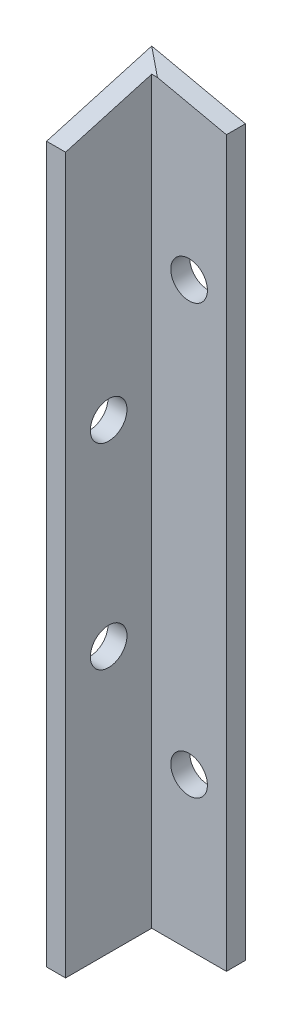
ISO-10303-21;
HEADER;
FILE_DESCRIPTION(('STEP AP214'),'2;1');
FILE_NAME('part.step','',(''),(''),'','','');
FILE_SCHEMA(('AUTOMOTIVE_DESIGN { 1 0 10303 214 1 1 1 1 }'));
ENDSEC;
DATA;
#1=APPLICATION_CONTEXT('core data for automotive mechanical design processes');
#2=APPLICATION_PROTOCOL_DEFINITION('international standard','automotive_design',2000,#1);
#3=PRODUCT_CONTEXT('',#1,'mechanical');
#4=PRODUCT('Part','Part','',(#3));
#5=PRODUCT_RELATED_PRODUCT_CATEGORY('part','',(#4));
#6=PRODUCT_DEFINITION_FORMATION('','',#4);
#7=PRODUCT_DEFINITION_CONTEXT('part definition',#1,'design');
#8=PRODUCT_DEFINITION('design','',#6,#7);
#9=PRODUCT_DEFINITION_SHAPE('','',#8);
#10=(LENGTH_UNIT() NAMED_UNIT(*) SI_UNIT(.MILLI.,.METRE.));
#11=(NAMED_UNIT(*) PLANE_ANGLE_UNIT() SI_UNIT($,.RADIAN.));
#12=(NAMED_UNIT(*) SI_UNIT($,.STERADIAN.) SOLID_ANGLE_UNIT());
#13=UNCERTAINTY_MEASURE_WITH_UNIT(LENGTH_MEASURE(1.E-05),#10,'distance_accuracy_value','');
#14=(GEOMETRIC_REPRESENTATION_CONTEXT(3) GLOBAL_UNCERTAINTY_ASSIGNED_CONTEXT((#13)) GLOBAL_UNIT_ASSIGNED_CONTEXT((#10,
#11,#12)) REPRESENTATION_CONTEXT('',''));
#15=CARTESIAN_POINT('',(0.,0.,0.));
#16=DIRECTION('',(0.,0.,1.));
#17=DIRECTION('',(1.,0.,0.));
#18=AXIS2_PLACEMENT_3D('',#15,#16,#17);
#19=CARTESIAN_POINT('',(0.,100.,0.));
#20=DIRECTION('',(0.,0.,-1.));
#21=DIRECTION('',(-1.,0.,0.));
#22=AXIS2_PLACEMENT_3D('',#19,#20,#21);
#23=PLANE('',#22);
#24=DIRECTION('',(0.,-1.,0.));
#25=VECTOR('',#24,1.);
#26=CARTESIAN_POINT('',(2.5,100.,0.));
#27=LINE('',#26,#25);
#28=CARTESIAN_POINT('',(2.5,94.2174692830297,0.));
#29=VERTEX_POINT('',#28);
#30=CARTESIAN_POINT('',(2.5,0.,0.));
#31=VERTEX_POINT('',#30);
#32=EDGE_CURVE('E165',#29,#31,#27,.T.);
#33=ORIENTED_EDGE('',*,*,#32,.F.);
#34=DIRECTION('',(-1.,0.,0.));
#35=VECTOR('',#34,1.);
#36=CARTESIAN_POINT('',(0.,94.2174692830297,0.));
#37=LINE('',#36,#35);
#38=CARTESIAN_POINT('',(0.,94.2174692830297,0.));
#39=VERTEX_POINT('',#38);
#40=EDGE_CURVE('E122',#29,#39,#37,.T.);
#41=ORIENTED_EDGE('',*,*,#40,.T.);
#42=DIRECTION('',(0.,-1.,0.));
#43=VECTOR('',#42,1.);
#44=CARTESIAN_POINT('',(0.,100.,0.));
#45=LINE('',#44,#43);
#46=CARTESIAN_POINT('',(0.,0.,0.));
#47=VERTEX_POINT('',#46);
#48=EDGE_CURVE('E120',#39,#47,#45,.T.);
#49=ORIENTED_EDGE('',*,*,#48,.T.);
#50=DIRECTION('',(1.,0.,0.));
#51=VECTOR('',#50,1.);
#52=CARTESIAN_POINT('',(0.,0.,0.));
#53=LINE('',#52,#51);
#54=EDGE_CURVE('E121',#47,#31,#53,.T.);
#55=ORIENTED_EDGE('',*,*,#54,.T.);
#56=EDGE_LOOP('',(#33,#41,#49,#55));
#57=FACE_BOUND('',#56,.T.);
#58=ADVANCED_FACE('F37',(#57),#23,.F.);
#59=CARTESIAN_POINT('',(2.5,100.,0.));
#60=DIRECTION('',(-1.,0.,0.));
#61=DIRECTION('',(0.,0.,1.));
#62=AXIS2_PLACEMENT_3D('',#59,#60,#61);
#63=PLANE('',#62);
#64=CARTESIAN_POINT('',(2.5,35.,-5.675));
#65=DIRECTION('',(1.,0.,0.));
#66=DIRECTION('',(0.,0.,-1.));
#67=AXIS2_PLACEMENT_3D('',#64,#65,#66);
#68=CIRCLE('',#67,2.415);
#69=CARTESIAN_POINT('',(2.5,35.,-8.09));
#70=VERTEX_POINT('',#69);
#71=EDGE_CURVE('E128',#70,#70,#68,.T.);
#72=ORIENTED_EDGE('',*,*,#71,.F.);
#73=EDGE_LOOP('',(#72));
#74=FACE_BOUND('',#73,.T.);
#75=CARTESIAN_POINT('',(2.5,60.8318940802685,-5.675));
#76=DIRECTION('',(1.,0.,0.));
#77=DIRECTION('',(0.,0.,-1.));
#78=AXIS2_PLACEMENT_3D('',#75,#76,#77);
#79=CIRCLE('',#78,2.415);
#80=CARTESIAN_POINT('',(2.5,60.8318940802685,-8.09));
#81=VERTEX_POINT('',#80);
#82=EDGE_CURVE('E137',#81,#81,#79,.T.);
#83=ORIENTED_EDGE('',*,*,#82,.F.);
#84=EDGE_LOOP('',(#83));
#85=FACE_BOUND('',#84,.T.);
#86=DIRECTION('',(0.,-1.,0.));
#87=VECTOR('',#86,1.);
#88=CARTESIAN_POINT('',(2.5,100.,-11.35));
#89=LINE('',#88,#87);
#90=CARTESIAN_POINT('',(2.5,97.4463188775074,-11.35));
#91=VERTEX_POINT('',#90);
#92=CARTESIAN_POINT('',(2.5,0.,-11.35));
#93=VERTEX_POINT('',#92);
#94=EDGE_CURVE('E111',#91,#93,#89,.T.);
#95=ORIENTED_EDGE('',*,*,#94,.F.);
#96=DIRECTION('',(0.,-0.273623490960616,0.961836880762287));
#97=VECTOR('',#96,1.);
#98=CARTESIAN_POINT('',(2.5,94.6504062869162,-1.52185317102299));
#99=LINE('',#98,#97);
#100=EDGE_CURVE('E153',#91,#29,#99,.T.);
#101=ORIENTED_EDGE('',*,*,#100,.T.);
#102=ORIENTED_EDGE('',*,*,#32,.T.);
#103=DIRECTION('',(0.,0.,-1.));
#104=VECTOR('',#103,1.);
#105=CARTESIAN_POINT('',(2.5,0.,0.));
#106=LINE('',#105,#104);
#107=EDGE_CURVE('E162',#31,#93,#106,.T.);
#108=ORIENTED_EDGE('',*,*,#107,.T.);
#109=EDGE_LOOP('',(#95,#101,#102,#108));
#110=FACE_BOUND('',#109,.T.);
#111=ADVANCED_FACE('F173',(#74,#85,#110),#63,.F.);
#112=CARTESIAN_POINT('',(2.5,100.,-11.35));
#113=DIRECTION('',(0.,0.,-1.));
#114=DIRECTION('',(-1.,0.,0.));
#115=AXIS2_PLACEMENT_3D('',#112,#113,#114);
#116=PLANE('',#115);
#117=CARTESIAN_POINT('',(7.42,20.,-11.35));
#118=DIRECTION('',(0.,0.,1.));
#119=DIRECTION('',(1.,0.,0.));
#120=AXIS2_PLACEMENT_3D('',#117,#118,#119);
#121=CIRCLE('',#120,2.415);
#122=CARTESIAN_POINT('',(9.835,20.,-11.35));
#123=VERTEX_POINT('',#122);
#124=EDGE_CURVE('E133',#123,#123,#121,.T.);
#125=ORIENTED_EDGE('',*,*,#124,.F.);
#126=EDGE_LOOP('',(#125));
#127=FACE_BOUND('',#126,.T.);
#128=CARTESIAN_POINT('',(7.42,76.4509969360503,-11.35));
#129=DIRECTION('',(0.,0.,1.));
#130=DIRECTION('',(1.,0.,0.));
#131=AXIS2_PLACEMENT_3D('',#128,#129,#130);
#132=CIRCLE('',#131,2.415);
#133=CARTESIAN_POINT('',(9.835,76.4509969360503,-11.35));
#134=VERTEX_POINT('',#133);
#135=EDGE_CURVE('E139',#134,#134,#132,.T.);
#136=ORIENTED_EDGE('',*,*,#135,.F.);
#137=EDGE_LOOP('',(#136));
#138=FACE_BOUND('',#137,.T.);
#139=DIRECTION('',(0.976859298345142,-0.213882938161597,0.));
#140=VECTOR('',#139,1.);
#141=CARTESIAN_POINT('',(2.00067787036335,97.7194652860223,-11.35));
#142=LINE('',#141,#140);
#143=CARTESIAN_POINT('',(3.24820893226524,97.4463188775074,-11.35));
#144=VERTEX_POINT('',#143);
#145=CARTESIAN_POINT('',(12.34,95.4556749945933,-11.35));
#146=VERTEX_POINT('',#145);
#147=EDGE_CURVE('E88',#144,#146,#142,.T.);
#148=ORIENTED_EDGE('',*,*,#147,.F.);
#149=DIRECTION('',(-1.,0.,0.));
#150=VECTOR('',#149,1.);
#151=CARTESIAN_POINT('',(2.5,97.4463188775074,-11.35));
#152=LINE('',#151,#150);
#153=EDGE_CURVE('E52',#144,#91,#152,.T.);
#154=ORIENTED_EDGE('',*,*,#153,.T.);
#155=ORIENTED_EDGE('',*,*,#94,.T.);
#156=DIRECTION('',(1.,0.,0.));
#157=VECTOR('',#156,1.);
#158=CARTESIAN_POINT('',(2.5,0.,-11.35));
#159=LINE('',#158,#157);
#160=CARTESIAN_POINT('',(12.34,0.,-11.35));
#161=VERTEX_POINT('',#160);
#162=EDGE_CURVE('E106',#93,#161,#159,.T.);
#163=ORIENTED_EDGE('',*,*,#162,.T.);
#164=DIRECTION('',(0.,-1.,0.));
#165=VECTOR('',#164,1.);
#166=CARTESIAN_POINT('',(12.34,100.,-11.35));
#167=LINE('',#166,#165);
#168=EDGE_CURVE('E100',#146,#161,#167,.T.);
#169=ORIENTED_EDGE('',*,*,#168,.F.);
#170=EDGE_LOOP('',(#148,#154,#155,#163,#169));
#171=FACE_BOUND('',#170,.T.);
#172=ADVANCED_FACE('F104',(#127,#138,#171),#116,.F.);
#173=CARTESIAN_POINT('',(12.34,100.,-11.35));
#174=DIRECTION('',(-1.,0.,0.));
#175=DIRECTION('',(0.,0.,1.));
#176=AXIS2_PLACEMENT_3D('',#173,#174,#175);
#177=PLANE('',#176);
#178=DIRECTION('',(0.,0.,-1.));
#179=VECTOR('',#178,1.);
#180=CARTESIAN_POINT('',(12.34,95.4556749945933,-11.35));
#181=LINE('',#180,#179);
#182=CARTESIAN_POINT('',(12.34,95.4556749945933,-13.85));
#183=VERTEX_POINT('',#182);
#184=EDGE_CURVE('E91',#146,#183,#181,.T.);
#185=ORIENTED_EDGE('',*,*,#184,.F.);
#186=ORIENTED_EDGE('',*,*,#168,.T.);
#187=DIRECTION('',(0.,0.,-1.));
#188=VECTOR('',#187,1.);
#189=CARTESIAN_POINT('',(12.34,0.,-11.35));
#190=LINE('',#189,#188);
#191=CARTESIAN_POINT('',(12.34,0.,-13.85));
#192=VERTEX_POINT('',#191);
#193=EDGE_CURVE('E108',#161,#192,#190,.T.);
#194=ORIENTED_EDGE('',*,*,#193,.T.);
#195=DIRECTION('',(0.,-1.,0.));
#196=VECTOR('',#195,1.);
#197=CARTESIAN_POINT('',(12.34,100.,-13.85));
#198=LINE('',#197,#196);
#199=EDGE_CURVE('E102',#183,#192,#198,.T.);
#200=ORIENTED_EDGE('',*,*,#199,.F.);
#201=EDGE_LOOP('',(#185,#186,#194,#200));
#202=FACE_BOUND('',#201,.T.);
#203=ADVANCED_FACE('F98',(#202),#177,.F.);
#204=CARTESIAN_POINT('',(0.,100.,-13.85));
#205=DIRECTION('',(0.,0.,1.));
#206=DIRECTION('',(1.,0.,0.));
#207=AXIS2_PLACEMENT_3D('',#204,#205,#206);
#208=PLANE('',#207);
#209=CARTESIAN_POINT('',(7.42,20.,-13.85));
#210=DIRECTION('',(0.,0.,1.));
#211=DIRECTION('',(1.,0.,0.));
#212=AXIS2_PLACEMENT_3D('',#209,#210,#211);
#213=CIRCLE('',#212,2.415);
#214=CARTESIAN_POINT('',(9.835,20.,-13.85));
#215=VERTEX_POINT('',#214);
#216=EDGE_CURVE('E40',#215,#215,#213,.T.);
#217=ORIENTED_EDGE('',*,*,#216,.T.);
#218=EDGE_LOOP('',(#217));
#219=FACE_BOUND('',#218,.T.);
#220=CARTESIAN_POINT('',(7.42,76.4509969360503,-13.85));
#221=DIRECTION('',(0.,0.,1.));
#222=DIRECTION('',(1.,0.,0.));
#223=AXIS2_PLACEMENT_3D('',#220,#221,#222);
#224=CIRCLE('',#223,2.415);
#225=CARTESIAN_POINT('',(9.835,76.4509969360503,-13.85));
#226=VERTEX_POINT('',#225);
#227=EDGE_CURVE('E131',#226,#226,#224,.T.);
#228=ORIENTED_EDGE('',*,*,#227,.T.);
#229=EDGE_LOOP('',(#228));
#230=FACE_BOUND('',#229,.T.);
#231=DIRECTION('',(0.976859298345142,-0.213882938161597,0.));
#232=VECTOR('',#231,1.);
#233=CARTESIAN_POINT('',(0.,98.1575128758371,-13.85));
#234=LINE('',#233,#232);
#235=CARTESIAN_POINT('',(0.,98.1575128758371,-13.85));
#236=VERTEX_POINT('',#235);
#237=EDGE_CURVE('E61',#236,#183,#234,.T.);
#238=ORIENTED_EDGE('',*,*,#237,.T.);
#239=ORIENTED_EDGE('',*,*,#199,.T.);
#240=DIRECTION('',(-1.,0.,0.));
#241=VECTOR('',#240,1.);
#242=CARTESIAN_POINT('',(0.,0.,-13.85));
#243=LINE('',#242,#241);
#244=CARTESIAN_POINT('',(0.,0.,-13.85));
#245=VERTEX_POINT('',#244);
#246=EDGE_CURVE('E117',#192,#245,#243,.T.);
#247=ORIENTED_EDGE('',*,*,#246,.T.);
#248=DIRECTION('',(0.,-1.,0.));
#249=VECTOR('',#248,1.);
#250=CARTESIAN_POINT('',(0.,100.,-13.85));
#251=LINE('',#250,#249);
#252=EDGE_CURVE('E118',#236,#245,#251,.T.);
#253=ORIENTED_EDGE('',*,*,#252,.F.);
#254=EDGE_LOOP('',(#238,#239,#247,#253));
#255=FACE_BOUND('',#254,.T.);
#256=ADVANCED_FACE('F188',(#219,#230,#255),#208,.F.);
#257=CARTESIAN_POINT('',(0.,100.,0.));
#258=DIRECTION('',(1.,0.,0.));
#259=DIRECTION('',(0.,0.,-1.));
#260=AXIS2_PLACEMENT_3D('',#257,#258,#259);
#261=PLANE('',#260);
#262=CARTESIAN_POINT('',(0.,35.,-5.675));
#263=DIRECTION('',(1.,0.,0.));
#264=DIRECTION('',(0.,0.,-1.));
#265=AXIS2_PLACEMENT_3D('',#262,#263,#264);
#266=CIRCLE('',#265,2.415);
#267=CARTESIAN_POINT('',(0.,35.,-8.09));
#268=VERTEX_POINT('',#267);
#269=EDGE_CURVE('E127',#268,#268,#266,.T.);
#270=ORIENTED_EDGE('',*,*,#269,.T.);
#271=EDGE_LOOP('',(#270));
#272=FACE_BOUND('',#271,.T.);
#273=CARTESIAN_POINT('',(0.,60.8318940802685,-5.675));
#274=DIRECTION('',(1.,0.,0.));
#275=DIRECTION('',(0.,0.,-1.));
#276=AXIS2_PLACEMENT_3D('',#273,#274,#275);
#277=CIRCLE('',#276,2.415);
#278=CARTESIAN_POINT('',(0.,60.8318940802685,-8.09));
#279=VERTEX_POINT('',#278);
#280=EDGE_CURVE('E124',#279,#279,#277,.T.);
#281=ORIENTED_EDGE('',*,*,#280,.T.);
#282=EDGE_LOOP('',(#281));
#283=FACE_BOUND('',#282,.T.);
#284=ORIENTED_EDGE('',*,*,#48,.F.);
#285=DIRECTION('',(0.,-0.273623490960616,0.961836880762287));
#286=VECTOR('',#285,1.);
#287=CARTESIAN_POINT('',(0.,98.1575128758371,-13.8499776684699));
#288=LINE('',#287,#286);
#289=CARTESIAN_POINT('',(0.,98.1575128758371,-13.8499776684699));
#290=VERTEX_POINT('',#289);
#291=EDGE_CURVE('E130',#290,#39,#288,.T.);
#292=ORIENTED_EDGE('',*,*,#291,.F.);
#293=DIRECTION('',(0.,0.,1.));
#294=VECTOR('',#293,1.);
#295=CARTESIAN_POINT('',(0.,98.1575128758371,0.));
#296=LINE('',#295,#294);
#297=EDGE_CURVE('E45',#236,#290,#296,.T.);
#298=ORIENTED_EDGE('',*,*,#297,.F.);
#299=ORIENTED_EDGE('',*,*,#252,.T.);
#300=DIRECTION('',(0.,0.,1.));
#301=VECTOR('',#300,1.);
#302=CARTESIAN_POINT('',(0.,0.,0.));
#303=LINE('',#302,#301);
#304=EDGE_CURVE('E94',#245,#47,#303,.T.);
#305=ORIENTED_EDGE('',*,*,#304,.T.);
#306=EDGE_LOOP('',(#284,#292,#298,#299,#305));
#307=FACE_BOUND('',#306,.T.);
#308=ADVANCED_FACE('F184',(#272,#283,#307),#261,.F.);
#309=CARTESIAN_POINT('',(0.,0.,0.));
#310=DIRECTION('',(0.,1.,0.));
#311=DIRECTION('',(0.,0.,1.));
#312=AXIS2_PLACEMENT_3D('',#309,#310,#311);
#313=PLANE('',#312);
#314=ORIENTED_EDGE('',*,*,#54,.F.);
#315=ORIENTED_EDGE('',*,*,#304,.F.);
#316=ORIENTED_EDGE('',*,*,#246,.F.);
#317=ORIENTED_EDGE('',*,*,#193,.F.);
#318=ORIENTED_EDGE('',*,*,#162,.F.);
#319=ORIENTED_EDGE('',*,*,#107,.F.);
#320=EDGE_LOOP('',(#314,#315,#316,#317,#318,#319));
#321=FACE_BOUND('',#320,.T.);
#322=ADVANCED_FACE('F177',(#321),#313,.F.);
#323=CARTESIAN_POINT('',(0.,98.1575128758371,2.15));
#324=DIRECTION('',(0.213882938161597,0.976859298345142,0.));
#325=DIRECTION('',(-0.976859298345142,0.213882938161597,0.));
#326=AXIS2_PLACEMENT_3D('',#323,#324,#325);
#327=PLANE('',#326);
#328=DIRECTION('',(-0.780798102649057,0.170955420692097,-0.600939736608939));
#329=VECTOR('',#328,1.);
#330=CARTESIAN_POINT('',(7.50739122017548,96.5137726823211,-8.0719286604534));
#331=LINE('',#330,#329);
#332=EDGE_CURVE('E11',#144,#290,#331,.T.);
#333=ORIENTED_EDGE('',*,*,#332,.F.);
#334=ORIENTED_EDGE('',*,*,#147,.T.);
#335=ORIENTED_EDGE('',*,*,#184,.T.);
#336=ORIENTED_EDGE('',*,*,#237,.F.);
#337=ORIENTED_EDGE('',*,*,#297,.T.);
#338=EDGE_LOOP('',(#333,#334,#335,#336,#337));
#339=FACE_BOUND('',#338,.T.);
#340=ADVANCED_FACE('F90',(#339),#327,.T.);
#341=CARTESIAN_POINT('',(16.,98.1575128758371,-13.8499776684699));
#342=DIRECTION('',(0.,-0.961836880762287,-0.273623490960616));
#343=DIRECTION('',(0.,0.273623490960616,-0.961836880762287));
#344=AXIS2_PLACEMENT_3D('',#341,#342,#343);
#345=PLANE('',#344);
#346=ORIENTED_EDGE('',*,*,#100,.F.);
#347=ORIENTED_EDGE('',*,*,#153,.F.);
#348=ORIENTED_EDGE('',*,*,#332,.T.);
#349=ORIENTED_EDGE('',*,*,#291,.T.);
#350=ORIENTED_EDGE('',*,*,#40,.F.);
#351=EDGE_LOOP('',(#346,#347,#348,#349,#350));
#352=FACE_BOUND('',#351,.T.);
#353=ADVANCED_FACE('F217',(#352),#345,.F.);
#354=CARTESIAN_POINT('',(-13.5,60.8318940802685,-5.675));
#355=DIRECTION('',(1.,0.,0.));
#356=DIRECTION('',(0.,0.,-1.));
#357=AXIS2_PLACEMENT_3D('',#354,#355,#356);
#358=CYLINDRICAL_SURFACE('',#357,2.415);
#359=ORIENTED_EDGE('',*,*,#82,.T.);
#360=EDGE_LOOP('',(#359));
#361=FACE_BOUND('',#360,.T.);
#362=ORIENTED_EDGE('',*,*,#280,.F.);
#363=EDGE_LOOP('',(#362));
#364=FACE_BOUND('',#363,.T.);
#365=ADVANCED_FACE('F213',(#361,#364),#358,.F.);
#366=CARTESIAN_POINT('',(-13.5,35.,-5.675));
#367=DIRECTION('',(1.,0.,0.));
#368=DIRECTION('',(0.,0.,-1.));
#369=AXIS2_PLACEMENT_3D('',#366,#367,#368);
#370=CYLINDRICAL_SURFACE('',#369,2.415);
#371=ORIENTED_EDGE('',*,*,#71,.T.);
#372=EDGE_LOOP('',(#371));
#373=FACE_BOUND('',#372,.T.);
#374=ORIENTED_EDGE('',*,*,#269,.F.);
#375=EDGE_LOOP('',(#374));
#376=FACE_BOUND('',#375,.T.);
#377=ADVANCED_FACE('F216',(#373,#376),#370,.F.);
#378=CARTESIAN_POINT('',(7.42,76.4509969360503,-27.35));
#379=DIRECTION('',(0.,0.,1.));
#380=DIRECTION('',(1.,0.,0.));
#381=AXIS2_PLACEMENT_3D('',#378,#379,#380);
#382=CYLINDRICAL_SURFACE('',#381,2.415);
#383=ORIENTED_EDGE('',*,*,#135,.T.);
#384=EDGE_LOOP('',(#383));
#385=FACE_BOUND('',#384,.T.);
#386=ORIENTED_EDGE('',*,*,#227,.F.);
#387=EDGE_LOOP('',(#386));
#388=FACE_BOUND('',#387,.T.);
#389=ADVANCED_FACE('F225',(#385,#388),#382,.F.);
#390=CARTESIAN_POINT('',(7.42,20.,-27.35));
#391=DIRECTION('',(0.,0.,1.));
#392=DIRECTION('',(1.,0.,0.));
#393=AXIS2_PLACEMENT_3D('',#390,#391,#392);
#394=CYLINDRICAL_SURFACE('',#393,2.415);
#395=ORIENTED_EDGE('',*,*,#124,.T.);
#396=EDGE_LOOP('',(#395));
#397=FACE_BOUND('',#396,.T.);
#398=ORIENTED_EDGE('',*,*,#216,.F.);
#399=EDGE_LOOP('',(#398));
#400=FACE_BOUND('',#399,.T.);
#401=ADVANCED_FACE('F284',(#397,#400),#394,.F.);
#402=CLOSED_SHELL('',(#58,#111,#172,#203,#256,#308,#322,#340,#353,#365,#377,#389,#401));
#403=MANIFOLD_SOLID_BREP('B2',#402);
#404=ADVANCED_BREP_SHAPE_REPRESENTATION('',(#18,#403),#14);
#405=SHAPE_DEFINITION_REPRESENTATION(#9,#404);
ENDSEC;
END-ISO-10303-21;
